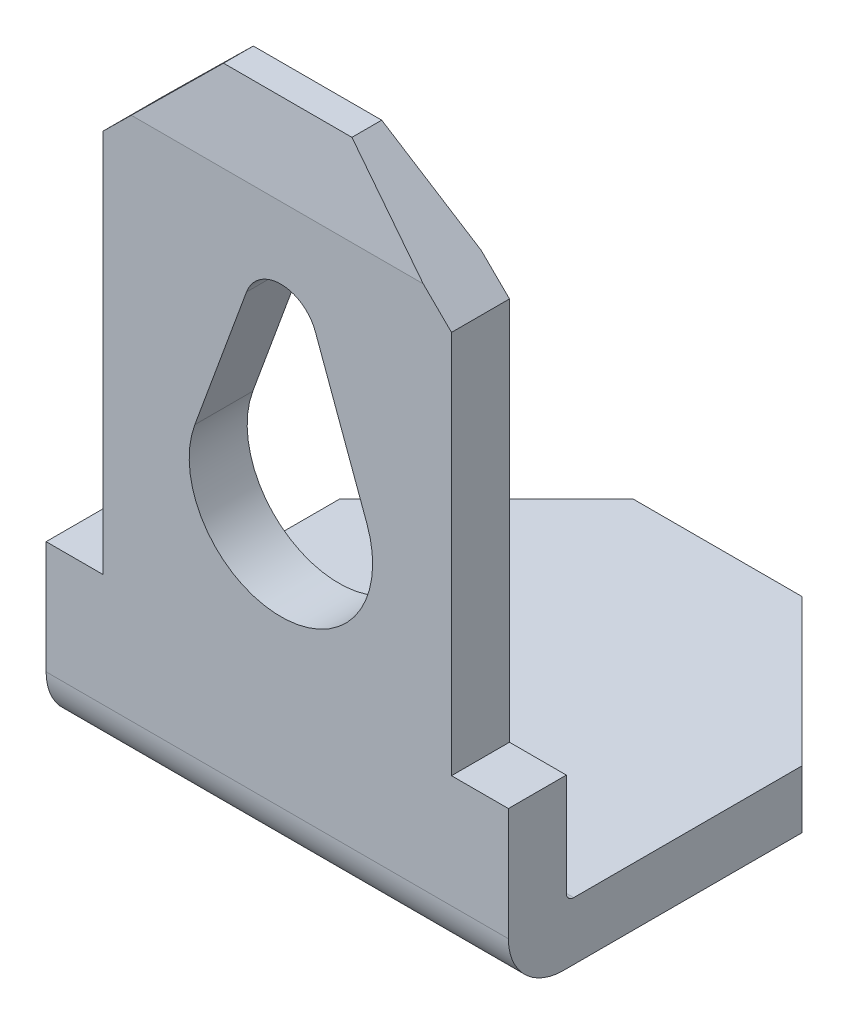
ISO-10303-21;
HEADER;
FILE_DESCRIPTION(('STEP AP214'),'2;1');
FILE_NAME('part.step','',(''),(''),'','','');
FILE_SCHEMA(('AUTOMOTIVE_DESIGN { 1 0 10303 214 1 1 1 1 }'));
ENDSEC;
DATA;
#1=APPLICATION_CONTEXT('core data for automotive mechanical design processes');
#2=APPLICATION_PROTOCOL_DEFINITION('international standard','automotive_design',2000,#1);
#3=PRODUCT_CONTEXT('',#1,'mechanical');
#4=PRODUCT('Part','Part','',(#3));
#5=PRODUCT_RELATED_PRODUCT_CATEGORY('part','',(#4));
#6=PRODUCT_DEFINITION_FORMATION('','',#4);
#7=PRODUCT_DEFINITION_CONTEXT('part definition',#1,'design');
#8=PRODUCT_DEFINITION('design','',#6,#7);
#9=PRODUCT_DEFINITION_SHAPE('','',#8);
#10=(LENGTH_UNIT() NAMED_UNIT(*) SI_UNIT(.MILLI.,.METRE.));
#11=(NAMED_UNIT(*) PLANE_ANGLE_UNIT() SI_UNIT($,.RADIAN.));
#12=(NAMED_UNIT(*) SI_UNIT($,.STERADIAN.) SOLID_ANGLE_UNIT());
#13=UNCERTAINTY_MEASURE_WITH_UNIT(LENGTH_MEASURE(1.E-05),#10,'distance_accuracy_value','');
#14=(GEOMETRIC_REPRESENTATION_CONTEXT(3) GLOBAL_UNCERTAINTY_ASSIGNED_CONTEXT((#13)) GLOBAL_UNIT_ASSIGNED_CONTEXT((#10,
#11,#12)) REPRESENTATION_CONTEXT('',''));
#15=CARTESIAN_POINT('',(0.,0.,0.));
#16=DIRECTION('',(0.,0.,1.));
#17=DIRECTION('',(1.,0.,0.));
#18=AXIS2_PLACEMENT_3D('',#15,#16,#17);
#19=CARTESIAN_POINT('',(6.3,7.11,0.));
#20=DIRECTION('',(0.,-0.214348018272917,0.976757353216485));
#21=DIRECTION('',(0.,-0.976757353216485,-0.214348018272917));
#22=AXIS2_PLACEMENT_3D('',#19,#20,#21);
#23=PLANE('',#22);
#24=DIRECTION('',(-1.,0.,0.));
#25=VECTOR('',#24,1.);
#26=CARTESIAN_POINT('',(6.3,8.21,0.24139344262295));
#27=LINE('',#26,#25);
#28=CARTESIAN_POINT('',(4.025,8.21,0.241393442622949));
#29=VERTEX_POINT('',#28);
#30=CARTESIAN_POINT('',(2.275,8.21,0.241393442622949));
#31=VERTEX_POINT('',#30);
#32=EDGE_CURVE('E206',#29,#31,#27,.T.);
#33=ORIENTED_EDGE('',*,*,#32,.F.);
#34=DIRECTION('',(0.703347952461325,-0.69432379783991,-0.152368374414198));
#35=VECTOR('',#34,1.);
#36=CARTESIAN_POINT('',(5.71349472092454,6.54316914741508,-0.124390228082159));
#37=LINE('',#36,#35);
#38=CARTESIAN_POINT('',(5.13929674470966,7.11,0.));
#39=VERTEX_POINT('',#38);
#40=EDGE_CURVE('E188',#29,#39,#37,.T.);
#41=ORIENTED_EDGE('',*,*,#40,.T.);
#42=DIRECTION('',(-1.,0.,0.));
#43=VECTOR('',#42,1.);
#44=CARTESIAN_POINT('',(6.3,7.11,0.));
#45=LINE('',#44,#43);
#46=CARTESIAN_POINT('',(1.16070325529034,7.11,0.));
#47=VERTEX_POINT('',#46);
#48=EDGE_CURVE('E246',#39,#47,#45,.T.);
#49=ORIENTED_EDGE('',*,*,#48,.T.);
#50=DIRECTION('',(0.703347952461325,0.69432379783991,0.152368374414198));
#51=VECTOR('',#50,1.);
#52=CARTESIAN_POINT('',(3.70310483513415,9.61978184321707,0.550768072151585));
#53=LINE('',#52,#51);
#54=EDGE_CURVE('E254',#47,#31,#53,.T.);
#55=ORIENTED_EDGE('',*,*,#54,.T.);
#56=EDGE_LOOP('',(#33,#41,#49,#55));
#57=FACE_BOUND('',#56,.T.);
#58=ADVANCED_FACE('F34',(#57),#23,.F.);
#59=CARTESIAN_POINT('',(6.3,8.21,0.24139344262295));
#60=DIRECTION('',(0.,-1.,0.));
#61=DIRECTION('',(0.,0.,-1.));
#62=AXIS2_PLACEMENT_3D('',#59,#60,#61);
#63=PLANE('',#62);
#64=DIRECTION('',(-1.,0.,0.));
#65=VECTOR('',#64,1.);
#66=CARTESIAN_POINT('',(6.3,8.21,0.64713114754098));
#67=LINE('',#66,#65);
#68=CARTESIAN_POINT('',(4.025,8.21,0.647131147540979));
#69=VERTEX_POINT('',#68);
#70=CARTESIAN_POINT('',(2.275,8.21,0.647131147540979));
#71=VERTEX_POINT('',#70);
#72=EDGE_CURVE('E203',#69,#71,#67,.T.);
#73=ORIENTED_EDGE('',*,*,#72,.F.);
#74=DIRECTION('',(0.,0.,1.));
#75=VECTOR('',#74,1.);
#76=CARTESIAN_POINT('',(4.025,8.21,-5.21));
#77=LINE('',#76,#75);
#78=EDGE_CURVE('E183',#29,#69,#77,.T.);
#79=ORIENTED_EDGE('',*,*,#78,.F.);
#80=ORIENTED_EDGE('',*,*,#32,.T.);
#81=DIRECTION('',(0.,0.,1.));
#82=VECTOR('',#81,1.);
#83=CARTESIAN_POINT('',(2.275,8.21,-5.21));
#84=LINE('',#83,#82);
#85=EDGE_CURVE('E198',#31,#71,#84,.T.);
#86=ORIENTED_EDGE('',*,*,#85,.T.);
#87=EDGE_LOOP('',(#73,#79,#80,#86));
#88=FACE_BOUND('',#87,.T.);
#89=ADVANCED_FACE('F415',(#88),#63,.F.);
#90=CARTESIAN_POINT('',(6.3,8.21,0.64713114754098));
#91=DIRECTION('',(0.,-0.128798962302804,-0.991670725245896));
#92=DIRECTION('',(0.,0.991670725245896,-0.128798962302804));
#93=AXIS2_PLACEMENT_3D('',#90,#91,#92);
#94=PLANE('',#93);
#95=DIRECTION('',(-1.,0.,0.));
#96=VECTOR('',#95,1.);
#97=CARTESIAN_POINT('',(6.3,7.11,0.79));
#98=LINE('',#97,#96);
#99=CARTESIAN_POINT('',(5.13929674470966,7.11,0.79));
#100=VERTEX_POINT('',#99);
#101=CARTESIAN_POINT('',(1.16070325529034,7.11,0.79));
#102=VERTEX_POINT('',#101);
#103=EDGE_CURVE('E195',#100,#102,#98,.T.);
#104=ORIENTED_EDGE('',*,*,#103,.F.);
#105=DIRECTION('',(-0.708713311399784,0.69962031769454,-0.0908672290418487));
#106=VECTOR('',#105,1.);
#107=CARTESIAN_POINT('',(5.16767461889319,7.0819862220274,0.793638451192715));
#108=LINE('',#107,#106);
#109=EDGE_CURVE('E180',#100,#69,#108,.T.);
#110=ORIENTED_EDGE('',*,*,#109,.T.);
#111=ORIENTED_EDGE('',*,*,#72,.T.);
#112=DIRECTION('',(-0.708713311399784,-0.69962031769454,0.0908672290418487));
#113=VECTOR('',#112,1.);
#114=CARTESIAN_POINT('',(4.29665509496487,10.2057166841054,0.387925918003296));
#115=LINE('',#114,#113);
#116=EDGE_CURVE('E202',#71,#102,#115,.T.);
#117=ORIENTED_EDGE('',*,*,#116,.T.);
#118=EDGE_LOOP('',(#104,#110,#111,#117));
#119=FACE_BOUND('',#118,.T.);
#120=ADVANCED_FACE('F201',(#119),#94,.F.);
#121=CARTESIAN_POINT('',(6.3,7.11,0.79));
#122=DIRECTION('',(0.,0.,-1.));
#123=DIRECTION('',(0.,1.,0.));
#124=AXIS2_PLACEMENT_3D('',#121,#122,#123);
#125=PLANE('',#124);
#126=DIRECTION('',(-0.344583937553277,-0.938755511291561,0.));
#127=VECTOR('',#126,1.);
#128=CARTESIAN_POINT('',(2.73062224435422,5.80882986931079,0.789999999999999));
#129=LINE('',#128,#127);
#130=CARTESIAN_POINT('',(2.73062224435422,5.80882986931079,0.79));
#131=VERTEX_POINT('',#130);
#132=CARTESIAN_POINT('',(2.02655561088555,3.89072992194159,0.789999999999999));
#133=VERTEX_POINT('',#132);
#134=EDGE_CURVE('E295',#131,#133,#129,.T.);
#135=ORIENTED_EDGE('',*,*,#134,.F.);
#136=CARTESIAN_POINT('',(3.2,5.63653790053415,0.789999999999999));
#137=DIRECTION('',(0.,0.,1.));
#138=DIRECTION('',(1.,0.,0.));
#139=AXIS2_PLACEMENT_3D('',#136,#137,#138);
#140=CIRCLE('',#139,0.5);
#141=CARTESIAN_POINT('',(3.66963395220552,5.8081302981974,0.789999999999999));
#142=VERTEX_POINT('',#141);
#143=EDGE_CURVE('E271',#142,#131,#140,.T.);
#144=ORIENTED_EDGE('',*,*,#143,.F.);
#145=DIRECTION('',(-0.344584192655147,0.938755417652649,0.));
#146=VECTOR('',#145,1.);
#147=CARTESIAN_POINT('',(3.66963395220552,5.8081302981974,0.789999999999999));
#148=LINE('',#147,#146);
#149=CARTESIAN_POINT('',(4.37344427206581,3.89073024081893,0.789999999999999));
#150=VERTEX_POINT('',#149);
#151=EDGE_CURVE('E301',#150,#142,#148,.T.);
#152=ORIENTED_EDGE('',*,*,#151,.F.);
#153=CARTESIAN_POINT('',(3.2,3.46,0.789999999999999));
#154=DIRECTION('',(0.,0.,1.));
#155=DIRECTION('',(1.,0.,0.));
#156=AXIS2_PLACEMENT_3D('',#153,#154,#155);
#157=CIRCLE('',#156,1.25);
#158=EDGE_CURVE('E298',#133,#150,#157,.T.);
#159=ORIENTED_EDGE('',*,*,#158,.F.);
#160=EDGE_LOOP('',(#135,#144,#152,#159));
#161=FACE_BOUND('',#160,.T.);
#162=DIRECTION('',(0.,-1.,0.));
#163=VECTOR('',#162,1.);
#164=CARTESIAN_POINT('',(5.525,1.49672365683442,0.789999999999999));
#165=LINE('',#164,#163);
#166=CARTESIAN_POINT('',(5.525,6.729245427366,0.79));
#167=VERTEX_POINT('',#166);
#168=CARTESIAN_POINT('',(5.525,1.49672365683442,0.789999999999999));
#169=VERTEX_POINT('',#168);
#170=EDGE_CURVE('E197',#167,#169,#165,.T.);
#171=ORIENTED_EDGE('',*,*,#170,.F.);
#172=DIRECTION('',(0.711657426770076,-0.702526659225822,0.));
#173=VECTOR('',#172,1.);
#174=CARTESIAN_POINT('',(5.54449556096771,6.71,0.79));
#175=LINE('',#174,#173);
#176=EDGE_CURVE('E56',#100,#167,#175,.T.);
#177=ORIENTED_EDGE('',*,*,#176,.F.);
#178=ORIENTED_EDGE('',*,*,#103,.T.);
#179=DIRECTION('',(0.711657426770076,0.702526659225822,0.));
#180=VECTOR('',#179,1.);
#181=CARTESIAN_POINT('',(0.755504439032288,6.71,0.79));
#182=LINE('',#181,#180);
#183=CARTESIAN_POINT('',(0.775,6.729245427366,0.79));
#184=VERTEX_POINT('',#183);
#185=EDGE_CURVE('E563',#184,#102,#182,.T.);
#186=ORIENTED_EDGE('',*,*,#185,.F.);
#187=DIRECTION('',(0.,1.,0.));
#188=VECTOR('',#187,1.);
#189=CARTESIAN_POINT('',(0.775,1.49672365683442,0.789999999999999));
#190=LINE('',#189,#188);
#191=CARTESIAN_POINT('',(0.775,1.49672365683442,0.789999999999999));
#192=VERTEX_POINT('',#191);
#193=EDGE_CURVE('E272',#192,#184,#190,.T.);
#194=ORIENTED_EDGE('',*,*,#193,.F.);
#195=DIRECTION('',(1.,0.,0.));
#196=VECTOR('',#195,1.);
#197=CARTESIAN_POINT('',(0.,1.49672365683442,0.789999999999999));
#198=LINE('',#197,#196);
#199=CARTESIAN_POINT('',(0.,1.49672365683442,0.789999999999999));
#200=VERTEX_POINT('',#199);
#201=EDGE_CURVE('E265',#200,#192,#198,.T.);
#202=ORIENTED_EDGE('',*,*,#201,.F.);
#203=DIRECTION('',(0.,-1.,0.));
#204=VECTOR('',#203,1.);
#205=CARTESIAN_POINT('',(0.,7.11,0.79));
#206=LINE('',#205,#204);
#207=CARTESIAN_POINT('',(0.,-0.0400000000000005,0.789999999999999));
#208=VERTEX_POINT('',#207);
#209=EDGE_CURVE('E313',#200,#208,#206,.T.);
#210=ORIENTED_EDGE('',*,*,#209,.T.);
#211=DIRECTION('',(-1.,0.,0.));
#212=VECTOR('',#211,1.);
#213=CARTESIAN_POINT('',(6.3,-0.0400000000000005,0.789999999999999));
#214=LINE('',#213,#212);
#215=CARTESIAN_POINT('',(6.3,-0.0400000000000005,0.789999999999999));
#216=VERTEX_POINT('',#215);
#217=EDGE_CURVE('E204',#216,#208,#214,.T.);
#218=ORIENTED_EDGE('',*,*,#217,.F.);
#219=DIRECTION('',(0.,-1.,0.));
#220=VECTOR('',#219,1.);
#221=CARTESIAN_POINT('',(6.3,7.11,0.79));
#222=LINE('',#221,#220);
#223=CARTESIAN_POINT('',(6.3,1.49672365683442,0.789999999999999));
#224=VERTEX_POINT('',#223);
#225=EDGE_CURVE('E314',#224,#216,#222,.T.);
#226=ORIENTED_EDGE('',*,*,#225,.F.);
#227=DIRECTION('',(1.,0.,0.));
#228=VECTOR('',#227,1.);
#229=CARTESIAN_POINT('',(6.3,1.49672365683442,0.789999999999999));
#230=LINE('',#229,#228);
#231=EDGE_CURVE('E260',#169,#224,#230,.T.);
#232=ORIENTED_EDGE('',*,*,#231,.F.);
#233=EDGE_LOOP('',(#171,#177,#178,#186,#194,#202,#210,#218,#226,#232));
#234=FACE_BOUND('',#233,.T.);
#235=ADVANCED_FACE('F193',(#161,#234),#125,.F.);
#236=CARTESIAN_POINT('',(6.3,-0.0400000000000006,0.0399999999999991));
#237=DIRECTION('',(-1.,0.,0.));
#238=DIRECTION('',(0.,0.,1.));
#239=AXIS2_PLACEMENT_3D('',#236,#237,#238);
#240=CYLINDRICAL_SURFACE('',#239,0.75);
#241=CARTESIAN_POINT('',(0.,-0.0400000000000006,0.0399999999999991));
#242=DIRECTION('',(1.,0.,0.));
#243=DIRECTION('',(0.,0.,-1.));
#244=AXIS2_PLACEMENT_3D('',#241,#242,#243);
#245=CIRCLE('',#244,0.75);
#246=CARTESIAN_POINT('',(0.,-0.790000000000001,0.0399999999999991));
#247=VERTEX_POINT('',#246);
#248=EDGE_CURVE('E330',#208,#247,#245,.T.);
#249=ORIENTED_EDGE('',*,*,#248,.T.);
#250=DIRECTION('',(-1.,0.,0.));
#251=VECTOR('',#250,1.);
#252=CARTESIAN_POINT('',(6.3,-0.790000000000001,0.0399999999999991));
#253=LINE('',#252,#251);
#254=CARTESIAN_POINT('',(6.3,-0.790000000000001,0.0399999999999991));
#255=VERTEX_POINT('',#254);
#256=EDGE_CURVE('E209',#255,#247,#253,.T.);
#257=ORIENTED_EDGE('',*,*,#256,.F.);
#258=CARTESIAN_POINT('',(6.3,-0.0400000000000006,0.0399999999999991));
#259=DIRECTION('',(1.,0.,0.));
#260=DIRECTION('',(0.,0.,-1.));
#261=AXIS2_PLACEMENT_3D('',#258,#259,#260);
#262=CIRCLE('',#261,0.75);
#263=EDGE_CURVE('E316',#216,#255,#262,.T.);
#264=ORIENTED_EDGE('',*,*,#263,.F.);
#265=ORIENTED_EDGE('',*,*,#217,.T.);
#266=EDGE_LOOP('',(#249,#257,#264,#265));
#267=FACE_BOUND('',#266,.T.);
#268=ADVANCED_FACE('F386',(#267),#240,.T.);
#269=CARTESIAN_POINT('',(6.3,-0.790000000000001,0.0399999999999991));
#270=DIRECTION('',(0.,1.,0.));
#271=DIRECTION('',(0.,0.,1.));
#272=AXIS2_PLACEMENT_3D('',#269,#270,#271);
#273=PLANE('',#272);
#274=DIRECTION('',(-1.,0.,0.));
#275=VECTOR('',#274,1.);
#276=CARTESIAN_POINT('',(6.3,-0.790000000000001,-5.21));
#277=LINE('',#276,#275);
#278=CARTESIAN_POINT('',(4.29999999999999,-0.790000000000001,-5.21));
#279=VERTEX_POINT('',#278);
#280=CARTESIAN_POINT('',(2.,-0.790000000000001,-5.21));
#281=VERTEX_POINT('',#280);
#282=EDGE_CURVE('E351',#279,#281,#277,.T.);
#283=ORIENTED_EDGE('',*,*,#282,.F.);
#284=DIRECTION('',(0.707106781186549,0.,0.707106781186546));
#285=VECTOR('',#284,1.);
#286=CARTESIAN_POINT('',(6.3,-0.790000000000001,-3.21));
#287=LINE('',#286,#285);
#288=CARTESIAN_POINT('',(6.3,-0.790000000000001,-3.21));
#289=VERTEX_POINT('',#288);
#290=EDGE_CURVE('E229',#279,#289,#287,.T.);
#291=ORIENTED_EDGE('',*,*,#290,.T.);
#292=DIRECTION('',(0.,0.,-1.));
#293=VECTOR('',#292,1.);
#294=CARTESIAN_POINT('',(6.3,-0.790000000000001,0.0399999999999991));
#295=LINE('',#294,#293);
#296=EDGE_CURVE('E319',#255,#289,#295,.T.);
#297=ORIENTED_EDGE('',*,*,#296,.F.);
#298=ORIENTED_EDGE('',*,*,#256,.T.);
#299=DIRECTION('',(0.,0.,-1.));
#300=VECTOR('',#299,1.);
#301=CARTESIAN_POINT('',(0.,-0.790000000000001,0.0399999999999991));
#302=LINE('',#301,#300);
#303=CARTESIAN_POINT('',(0.,-0.790000000000001,-3.21));
#304=VERTEX_POINT('',#303);
#305=EDGE_CURVE('E332',#247,#304,#302,.T.);
#306=ORIENTED_EDGE('',*,*,#305,.T.);
#307=DIRECTION('',(-0.707106781186546,0.,0.707106781186549));
#308=VECTOR('',#307,1.);
#309=CARTESIAN_POINT('',(2.,-0.790000000000001,-5.21));
#310=LINE('',#309,#308);
#311=EDGE_CURVE('E227',#304,#281,#310,.F.);
#312=ORIENTED_EDGE('',*,*,#311,.T.);
#313=EDGE_LOOP('',(#283,#291,#297,#298,#306,#312));
#314=FACE_BOUND('',#313,.T.);
#315=ADVANCED_FACE('F359',(#314),#273,.F.);
#316=CARTESIAN_POINT('',(6.3,-0.790000000000001,-5.21));
#317=DIRECTION('',(0.,0.,1.));
#318=DIRECTION('',(1.,0.,0.));
#319=AXIS2_PLACEMENT_3D('',#316,#317,#318);
#320=PLANE('',#319);
#321=DIRECTION('',(-1.,0.,0.));
#322=VECTOR('',#321,1.);
#323=CARTESIAN_POINT('',(6.3,0.,-5.21));
#324=LINE('',#323,#322);
#325=CARTESIAN_POINT('',(4.29999999999999,0.,-5.21));
#326=VERTEX_POINT('',#325);
#327=CARTESIAN_POINT('',(2.,0.,-5.21));
#328=VERTEX_POINT('',#327);
#329=EDGE_CURVE('E348',#326,#328,#324,.T.);
#330=ORIENTED_EDGE('',*,*,#329,.F.);
#331=DIRECTION('',(0.,-1.,0.));
#332=VECTOR('',#331,1.);
#333=CARTESIAN_POINT('',(4.29999999999999,-0.790000000000001,-5.21));
#334=LINE('',#333,#332);
#335=EDGE_CURVE('E225',#326,#279,#334,.T.);
#336=ORIENTED_EDGE('',*,*,#335,.T.);
#337=ORIENTED_EDGE('',*,*,#282,.T.);
#338=DIRECTION('',(0.,1.,0.));
#339=VECTOR('',#338,1.);
#340=CARTESIAN_POINT('',(2.,-0.790000000000001,-5.21));
#341=LINE('',#340,#339);
#342=EDGE_CURVE('E222',#281,#328,#341,.T.);
#343=ORIENTED_EDGE('',*,*,#342,.T.);
#344=EDGE_LOOP('',(#330,#336,#337,#343));
#345=FACE_BOUND('',#344,.T.);
#346=ADVANCED_FACE('F375',(#345),#320,.F.);
#347=CARTESIAN_POINT('',(6.3,0.,-5.21));
#348=DIRECTION('',(0.,-1.,0.));
#349=DIRECTION('',(0.,0.,-1.));
#350=AXIS2_PLACEMENT_3D('',#347,#348,#349);
#351=PLANE('',#350);
#352=DIRECTION('',(0.,0.,1.));
#353=VECTOR('',#352,1.);
#354=CARTESIAN_POINT('',(6.3,0.,-5.21));
#355=LINE('',#354,#353);
#356=CARTESIAN_POINT('',(6.3,0.,-3.21));
#357=VERTEX_POINT('',#356);
#358=CARTESIAN_POINT('',(6.3,0.,-0.100000000000001));
#359=VERTEX_POINT('',#358);
#360=EDGE_CURVE('E322',#357,#359,#355,.T.);
#361=ORIENTED_EDGE('',*,*,#360,.F.);
#362=DIRECTION('',(-0.707106781186549,0.,-0.707106781186546));
#363=VECTOR('',#362,1.);
#364=CARTESIAN_POINT('',(6.3,0.,-3.21));
#365=LINE('',#364,#363);
#366=EDGE_CURVE('E220',#357,#326,#365,.T.);
#367=ORIENTED_EDGE('',*,*,#366,.T.);
#368=ORIENTED_EDGE('',*,*,#329,.T.);
#369=DIRECTION('',(0.707106781186546,0.,-0.707106781186549));
#370=VECTOR('',#369,1.);
#371=CARTESIAN_POINT('',(2.,0.,-5.21));
#372=LINE('',#371,#370);
#373=CARTESIAN_POINT('',(0.,0.,-3.21));
#374=VERTEX_POINT('',#373);
#375=EDGE_CURVE('E218',#328,#374,#372,.F.);
#376=ORIENTED_EDGE('',*,*,#375,.T.);
#377=DIRECTION('',(0.,0.,1.));
#378=VECTOR('',#377,1.);
#379=CARTESIAN_POINT('',(0.,0.,-5.21));
#380=LINE('',#379,#378);
#381=CARTESIAN_POINT('',(0.,0.,-0.100000000000001));
#382=VERTEX_POINT('',#381);
#383=EDGE_CURVE('E335',#374,#382,#380,.T.);
#384=ORIENTED_EDGE('',*,*,#383,.T.);
#385=DIRECTION('',(-1.,0.,0.));
#386=VECTOR('',#385,1.);
#387=CARTESIAN_POINT('',(6.3,0.,-0.100000000000001));
#388=LINE('',#387,#386);
#389=EDGE_CURVE('E345',#359,#382,#388,.T.);
#390=ORIENTED_EDGE('',*,*,#389,.F.);
#391=EDGE_LOOP('',(#361,#367,#368,#376,#384,#390));
#392=FACE_BOUND('',#391,.T.);
#393=ADVANCED_FACE('F400',(#392),#351,.F.);
#394=CARTESIAN_POINT('',(6.3,0.1,-0.1));
#395=DIRECTION('',(-1.,0.,0.));
#396=DIRECTION('',(0.,0.,1.));
#397=AXIS2_PLACEMENT_3D('',#394,#395,#396);
#398=CYLINDRICAL_SURFACE('',#397,0.1);
#399=CARTESIAN_POINT('',(0.,0.1,-0.1));
#400=DIRECTION('',(-1.,0.,0.));
#401=DIRECTION('',(0.,0.,-1.));
#402=AXIS2_PLACEMENT_3D('',#399,#400,#401);
#403=CIRCLE('',#402,0.1);
#404=CARTESIAN_POINT('',(0.,0.100000000000001,0.));
#405=VERTEX_POINT('',#404);
#406=EDGE_CURVE('E337',#382,#405,#403,.T.);
#407=ORIENTED_EDGE('',*,*,#406,.T.);
#408=DIRECTION('',(-1.,0.,0.));
#409=VECTOR('',#408,1.);
#410=CARTESIAN_POINT('',(6.3,0.100000000000001,0.));
#411=LINE('',#410,#409);
#412=CARTESIAN_POINT('',(6.3,0.100000000000001,0.));
#413=VERTEX_POINT('',#412);
#414=EDGE_CURVE('E342',#413,#405,#411,.T.);
#415=ORIENTED_EDGE('',*,*,#414,.F.);
#416=CARTESIAN_POINT('',(6.3,0.1,-0.1));
#417=DIRECTION('',(-1.,0.,0.));
#418=DIRECTION('',(0.,0.,-1.));
#419=AXIS2_PLACEMENT_3D('',#416,#417,#418);
#420=CIRCLE('',#419,0.1);
#421=EDGE_CURVE('E324',#359,#413,#420,.T.);
#422=ORIENTED_EDGE('',*,*,#421,.F.);
#423=ORIENTED_EDGE('',*,*,#389,.T.);
#424=EDGE_LOOP('',(#407,#415,#422,#423));
#425=FACE_BOUND('',#424,.T.);
#426=ADVANCED_FACE('F397',(#425),#398,.F.);
#427=CARTESIAN_POINT('',(6.3,0.100000000000001,0.));
#428=DIRECTION('',(0.,0.,1.));
#429=DIRECTION('',(0.,-1.,0.));
#430=AXIS2_PLACEMENT_3D('',#427,#428,#429);
#431=PLANE('',#430);
#432=DIRECTION('',(0.344584192655147,-0.938755417652649,0.));
#433=VECTOR('',#432,1.);
#434=CARTESIAN_POINT('',(3.66963395220552,5.8081302981974,0.));
#435=LINE('',#434,#433);
#436=CARTESIAN_POINT('',(3.66963395220552,5.8081302981974,0.));
#437=VERTEX_POINT('',#436);
#438=CARTESIAN_POINT('',(4.37344427206581,3.89073024081893,0.));
#439=VERTEX_POINT('',#438);
#440=EDGE_CURVE('E288',#437,#439,#435,.T.);
#441=ORIENTED_EDGE('',*,*,#440,.F.);
#442=CARTESIAN_POINT('',(3.2,5.63653790053415,0.));
#443=DIRECTION('',(0.,0.,1.));
#444=DIRECTION('',(0.,-1.,0.));
#445=AXIS2_PLACEMENT_3D('',#442,#443,#444);
#446=CIRCLE('',#445,0.5);
#447=CARTESIAN_POINT('',(2.73062224435422,5.80882986931079,0.));
#448=VERTEX_POINT('',#447);
#449=EDGE_CURVE('E291',#448,#437,#446,.F.);
#450=ORIENTED_EDGE('',*,*,#449,.F.);
#451=DIRECTION('',(0.344583937553277,0.938755511291561,0.));
#452=VECTOR('',#451,1.);
#453=CARTESIAN_POINT('',(2.73062224435422,5.80882986931079,0.));
#454=LINE('',#453,#452);
#455=CARTESIAN_POINT('',(2.02655561088555,3.89072992194159,0.));
#456=VERTEX_POINT('',#455);
#457=EDGE_CURVE('E293',#456,#448,#454,.T.);
#458=ORIENTED_EDGE('',*,*,#457,.F.);
#459=CARTESIAN_POINT('',(3.2,3.46,0.));
#460=DIRECTION('',(0.,0.,1.));
#461=DIRECTION('',(0.,-1.,0.));
#462=AXIS2_PLACEMENT_3D('',#459,#460,#461);
#463=CIRCLE('',#462,1.25);
#464=EDGE_CURVE('E285',#439,#456,#463,.F.);
#465=ORIENTED_EDGE('',*,*,#464,.F.);
#466=EDGE_LOOP('',(#441,#450,#458,#465));
#467=FACE_BOUND('',#466,.T.);
#468=ORIENTED_EDGE('',*,*,#48,.F.);
#469=DIRECTION('',(0.711657426770076,-0.702526659225822,0.));
#470=VECTOR('',#469,1.);
#471=CARTESIAN_POINT('',(9.23184999768602,3.06995537127141,0.));
#472=LINE('',#471,#470);
#473=CARTESIAN_POINT('',(5.525,6.729245427366,0.));
#474=VERTEX_POINT('',#473);
#475=EDGE_CURVE('E239',#39,#474,#472,.T.);
#476=ORIENTED_EDGE('',*,*,#475,.T.);
#477=DIRECTION('',(0.,1.,0.));
#478=VECTOR('',#477,1.);
#479=CARTESIAN_POINT('',(5.525,1.49672365683442,0.));
#480=LINE('',#479,#478);
#481=CARTESIAN_POINT('',(5.525,1.49672365683442,0.));
#482=VERTEX_POINT('',#481);
#483=EDGE_CURVE('E237',#482,#474,#480,.T.);
#484=ORIENTED_EDGE('',*,*,#483,.F.);
#485=DIRECTION('',(-1.,0.,0.));
#486=VECTOR('',#485,1.);
#487=CARTESIAN_POINT('',(6.3,1.49672365683442,0.));
#488=LINE('',#487,#486);
#489=CARTESIAN_POINT('',(6.3,1.49672365683442,0.));
#490=VERTEX_POINT('',#489);
#491=EDGE_CURVE('E262',#490,#482,#488,.T.);
#492=ORIENTED_EDGE('',*,*,#491,.F.);
#493=DIRECTION('',(0.,1.,0.));
#494=VECTOR('',#493,1.);
#495=CARTESIAN_POINT('',(6.3,0.100000000000001,0.));
#496=LINE('',#495,#494);
#497=EDGE_CURVE('E326',#413,#490,#496,.T.);
#498=ORIENTED_EDGE('',*,*,#497,.F.);
#499=ORIENTED_EDGE('',*,*,#414,.T.);
#500=DIRECTION('',(0.,1.,0.));
#501=VECTOR('',#500,1.);
#502=CARTESIAN_POINT('',(0.,0.100000000000001,0.));
#503=LINE('',#502,#501);
#504=CARTESIAN_POINT('',(0.,1.49672365683442,0.));
#505=VERTEX_POINT('',#504);
#506=EDGE_CURVE('E317',#405,#505,#503,.T.);
#507=ORIENTED_EDGE('',*,*,#506,.T.);
#508=DIRECTION('',(-1.,0.,0.));
#509=VECTOR('',#508,1.);
#510=CARTESIAN_POINT('',(0.,1.49672365683442,0.));
#511=LINE('',#510,#509);
#512=CARTESIAN_POINT('',(0.775,1.49672365683442,0.));
#513=VERTEX_POINT('',#512);
#514=EDGE_CURVE('E278',#513,#505,#511,.T.);
#515=ORIENTED_EDGE('',*,*,#514,.F.);
#516=DIRECTION('',(0.,-1.,0.));
#517=VECTOR('',#516,1.);
#518=CARTESIAN_POINT('',(0.775,1.49672365683442,0.));
#519=LINE('',#518,#517);
#520=CARTESIAN_POINT('',(0.775,6.729245427366,0.));
#521=VERTEX_POINT('',#520);
#522=EDGE_CURVE('E258',#521,#513,#519,.T.);
#523=ORIENTED_EDGE('',*,*,#522,.F.);
#524=DIRECTION('',(0.711657426770076,0.702526659225822,0.));
#525=VECTOR('',#524,1.);
#526=CARTESIAN_POINT('',(0.258824648699115,6.21969275288617,0.));
#527=LINE('',#526,#525);
#528=EDGE_CURVE('E49',#521,#47,#527,.T.);
#529=ORIENTED_EDGE('',*,*,#528,.T.);
#530=EDGE_LOOP('',(#468,#476,#484,#492,#498,#499,#507,#515,#523,#529));
#531=FACE_BOUND('',#530,.T.);
#532=ADVANCED_FACE('F243',(#467,#531),#431,.F.);
#533=CARTESIAN_POINT('',(6.3,-0.0400000000000006,0.0399999999999991));
#534=DIRECTION('',(1.,0.,0.));
#535=DIRECTION('',(0.,0.,-1.));
#536=AXIS2_PLACEMENT_3D('',#533,#534,#535);
#537=PLANE('',#536);
#538=DIRECTION('',(0.,0.,-1.));
#539=VECTOR('',#538,1.);
#540=CARTESIAN_POINT('',(6.3,1.49672365683442,7.54786240313508));
#541=LINE('',#540,#539);
#542=EDGE_CURVE('E267',#224,#490,#541,.T.);
#543=ORIENTED_EDGE('',*,*,#542,.F.);
#544=ORIENTED_EDGE('',*,*,#225,.T.);
#545=ORIENTED_EDGE('',*,*,#263,.T.);
#546=ORIENTED_EDGE('',*,*,#296,.T.);
#547=DIRECTION('',(0.,1.,0.));
#548=VECTOR('',#547,1.);
#549=CARTESIAN_POINT('',(6.3,0.,-3.21));
#550=LINE('',#549,#548);
#551=EDGE_CURVE('E215',#289,#357,#550,.T.);
#552=ORIENTED_EDGE('',*,*,#551,.T.);
#553=ORIENTED_EDGE('',*,*,#360,.T.);
#554=ORIENTED_EDGE('',*,*,#421,.T.);
#555=ORIENTED_EDGE('',*,*,#497,.T.);
#556=EDGE_LOOP('',(#543,#544,#545,#546,#552,#553,#554,#555));
#557=FACE_BOUND('',#556,.T.);
#558=ADVANCED_FACE('F382',(#557),#537,.T.);
#559=CARTESIAN_POINT('',(0.,-0.0400000000000006,0.0399999999999991));
#560=DIRECTION('',(1.,0.,0.));
#561=DIRECTION('',(0.,0.,-1.));
#562=AXIS2_PLACEMENT_3D('',#559,#560,#561);
#563=PLANE('',#562);
#564=ORIENTED_EDGE('',*,*,#209,.F.);
#565=DIRECTION('',(0.,0.,-1.));
#566=VECTOR('',#565,1.);
#567=CARTESIAN_POINT('',(0.,1.49672365683442,7.54786240313508));
#568=LINE('',#567,#566);
#569=EDGE_CURVE('E275',#200,#505,#568,.T.);
#570=ORIENTED_EDGE('',*,*,#569,.T.);
#571=ORIENTED_EDGE('',*,*,#506,.F.);
#572=ORIENTED_EDGE('',*,*,#406,.F.);
#573=ORIENTED_EDGE('',*,*,#383,.F.);
#574=DIRECTION('',(0.,-1.,0.));
#575=VECTOR('',#574,1.);
#576=CARTESIAN_POINT('',(0.,-0.0400000000000006,-3.21));
#577=LINE('',#576,#575);
#578=EDGE_CURVE('E231',#374,#304,#577,.T.);
#579=ORIENTED_EDGE('',*,*,#578,.T.);
#580=ORIENTED_EDGE('',*,*,#305,.F.);
#581=ORIENTED_EDGE('',*,*,#248,.F.);
#582=EDGE_LOOP('',(#564,#570,#571,#572,#573,#579,#580,#581));
#583=FACE_BOUND('',#582,.T.);
#584=ADVANCED_FACE('F366',(#583),#563,.F.);
#585=CARTESIAN_POINT('',(6.3,-0.0400000000000006,-3.21));
#586=DIRECTION('',(0.707106781186546,0.,-0.707106781186549));
#587=DIRECTION('',(0.,-1.,0.));
#588=AXIS2_PLACEMENT_3D('',#585,#586,#587);
#589=PLANE('',#588);
#590=ORIENTED_EDGE('',*,*,#290,.F.);
#591=ORIENTED_EDGE('',*,*,#335,.F.);
#592=ORIENTED_EDGE('',*,*,#366,.F.);
#593=ORIENTED_EDGE('',*,*,#551,.F.);
#594=EDGE_LOOP('',(#590,#591,#592,#593));
#595=FACE_BOUND('',#594,.T.);
#596=ADVANCED_FACE('F378',(#595),#589,.T.);
#597=CARTESIAN_POINT('',(2.,-0.790000000000001,-5.21));
#598=DIRECTION('',(0.707106781186549,0.,0.707106781186546));
#599=DIRECTION('',(0.,1.,0.));
#600=AXIS2_PLACEMENT_3D('',#597,#598,#599);
#601=PLANE('',#600);
#602=ORIENTED_EDGE('',*,*,#311,.F.);
#603=ORIENTED_EDGE('',*,*,#578,.F.);
#604=ORIENTED_EDGE('',*,*,#375,.F.);
#605=ORIENTED_EDGE('',*,*,#342,.F.);
#606=EDGE_LOOP('',(#602,#603,#604,#605));
#607=FACE_BOUND('',#606,.T.);
#608=ADVANCED_FACE('F36',(#607),#601,.F.);
#609=CARTESIAN_POINT('',(3.2,5.63653790053415,-4.65485766531385));
#610=DIRECTION('',(0.,0.,1.));
#611=DIRECTION('',(1.,0.,0.));
#612=AXIS2_PLACEMENT_3D('',#609,#610,#611);
#613=CYLINDRICAL_SURFACE('',#612,0.5);
#614=ORIENTED_EDGE('',*,*,#449,.T.);
#615=DIRECTION('',(0.,0.,1.));
#616=VECTOR('',#615,1.);
#617=CARTESIAN_POINT('',(3.66963395220552,5.8081302981974,-4.65485766531385));
#618=LINE('',#617,#616);
#619=EDGE_CURVE('E289',#437,#142,#618,.T.);
#620=ORIENTED_EDGE('',*,*,#619,.T.);
#621=ORIENTED_EDGE('',*,*,#143,.T.);
#622=DIRECTION('',(0.,0.,1.));
#623=VECTOR('',#622,1.);
#624=CARTESIAN_POINT('',(2.73062224435422,5.80882986931079,-4.65485766531385));
#625=LINE('',#624,#623);
#626=EDGE_CURVE('E304',#448,#131,#625,.T.);
#627=ORIENTED_EDGE('',*,*,#626,.F.);
#628=EDGE_LOOP('',(#614,#620,#621,#627));
#629=FACE_BOUND('',#628,.T.);
#630=ADVANCED_FACE('F430',(#629),#613,.F.);
#631=CARTESIAN_POINT('',(3.66963395220552,5.8081302981974,-4.65485766531385));
#632=DIRECTION('',(0.93875541765265,0.344584192655147,0.));
#633=DIRECTION('',(-0.344584192655147,0.938755417652649,0.));
#634=AXIS2_PLACEMENT_3D('',#631,#632,#633);
#635=PLANE('',#634);
#636=ORIENTED_EDGE('',*,*,#440,.T.);
#637=DIRECTION('',(0.,0.,1.));
#638=VECTOR('',#637,1.);
#639=CARTESIAN_POINT('',(4.37344427206581,3.89073024081893,-4.65485766531385));
#640=LINE('',#639,#638);
#641=EDGE_CURVE('E306',#439,#150,#640,.T.);
#642=ORIENTED_EDGE('',*,*,#641,.T.);
#643=ORIENTED_EDGE('',*,*,#151,.T.);
#644=ORIENTED_EDGE('',*,*,#619,.F.);
#645=EDGE_LOOP('',(#636,#642,#643,#644));
#646=FACE_BOUND('',#645,.T.);
#647=ADVANCED_FACE('F572',(#646),#635,.F.);
#648=CARTESIAN_POINT('',(3.2,3.46,-4.65485766531385));
#649=DIRECTION('',(0.,0.,1.));
#650=DIRECTION('',(1.,0.,0.));
#651=AXIS2_PLACEMENT_3D('',#648,#649,#650);
#652=CYLINDRICAL_SURFACE('',#651,1.25);
#653=ORIENTED_EDGE('',*,*,#464,.T.);
#654=DIRECTION('',(0.,0.,1.));
#655=VECTOR('',#654,1.);
#656=CARTESIAN_POINT('',(2.02655561088555,3.89072992194159,-4.65485766531385));
#657=LINE('',#656,#655);
#658=EDGE_CURVE('E308',#456,#133,#657,.T.);
#659=ORIENTED_EDGE('',*,*,#658,.T.);
#660=ORIENTED_EDGE('',*,*,#158,.T.);
#661=ORIENTED_EDGE('',*,*,#641,.F.);
#662=EDGE_LOOP('',(#653,#659,#660,#661));
#663=FACE_BOUND('',#662,.T.);
#664=ADVANCED_FACE('F568',(#663),#652,.F.);
#665=CARTESIAN_POINT('',(2.73062224435422,5.80882986931079,-4.65485766531385));
#666=DIRECTION('',(-0.938755511291561,0.344583937553277,0.));
#667=DIRECTION('',(-0.344583937553277,-0.938755511291561,0.));
#668=AXIS2_PLACEMENT_3D('',#665,#666,#667);
#669=PLANE('',#668);
#670=ORIENTED_EDGE('',*,*,#457,.T.);
#671=ORIENTED_EDGE('',*,*,#626,.T.);
#672=ORIENTED_EDGE('',*,*,#134,.T.);
#673=ORIENTED_EDGE('',*,*,#658,.F.);
#674=EDGE_LOOP('',(#670,#671,#672,#673));
#675=FACE_BOUND('',#674,.T.);
#676=ADVANCED_FACE('F497',(#675),#669,.F.);
#677=CARTESIAN_POINT('',(0.775,1.49672365683442,7.54786240313508));
#678=DIRECTION('',(1.,0.,0.));
#679=DIRECTION('',(0.,0.,-1.));
#680=AXIS2_PLACEMENT_3D('',#677,#678,#679);
#681=PLANE('',#680);
#682=ORIENTED_EDGE('',*,*,#193,.T.);
#683=DIRECTION('',(0.,0.,-1.));
#684=VECTOR('',#683,1.);
#685=CARTESIAN_POINT('',(0.775,6.729245427366,7.54786240313508));
#686=LINE('',#685,#684);
#687=EDGE_CURVE('E11',#184,#521,#686,.T.);
#688=ORIENTED_EDGE('',*,*,#687,.T.);
#689=ORIENTED_EDGE('',*,*,#522,.T.);
#690=DIRECTION('',(0.,0.,-1.));
#691=VECTOR('',#690,1.);
#692=CARTESIAN_POINT('',(0.775,1.49672365683442,7.54786240313508));
#693=LINE('',#692,#691);
#694=EDGE_CURVE('E280',#192,#513,#693,.T.);
#695=ORIENTED_EDGE('',*,*,#694,.F.);
#696=EDGE_LOOP('',(#682,#688,#689,#695));
#697=FACE_BOUND('',#696,.T.);
#698=ADVANCED_FACE('F510',(#697),#681,.F.);
#699=CARTESIAN_POINT('',(0.,1.49672365683442,7.54786240313508));
#700=DIRECTION('',(0.,-1.,0.));
#701=DIRECTION('',(0.,0.,-1.));
#702=AXIS2_PLACEMENT_3D('',#699,#700,#701);
#703=PLANE('',#702);
#704=ORIENTED_EDGE('',*,*,#201,.T.);
#705=ORIENTED_EDGE('',*,*,#694,.T.);
#706=ORIENTED_EDGE('',*,*,#514,.T.);
#707=ORIENTED_EDGE('',*,*,#569,.F.);
#708=EDGE_LOOP('',(#704,#705,#706,#707));
#709=FACE_BOUND('',#708,.T.);
#710=ADVANCED_FACE('F411',(#709),#703,.F.);
#711=CARTESIAN_POINT('',(5.525,1.49672365683442,7.54786240313508));
#712=DIRECTION('',(-1.,0.,0.));
#713=DIRECTION('',(0.,0.,1.));
#714=AXIS2_PLACEMENT_3D('',#711,#712,#713);
#715=PLANE('',#714);
#716=ORIENTED_EDGE('',*,*,#483,.T.);
#717=DIRECTION('',(0.,0.,1.));
#718=VECTOR('',#717,1.);
#719=CARTESIAN_POINT('',(5.525,6.729245427366,7.54786240313508));
#720=LINE('',#719,#718);
#721=EDGE_CURVE('E42',#474,#167,#720,.T.);
#722=ORIENTED_EDGE('',*,*,#721,.T.);
#723=ORIENTED_EDGE('',*,*,#170,.T.);
#724=DIRECTION('',(0.,0.,-1.));
#725=VECTOR('',#724,1.);
#726=CARTESIAN_POINT('',(5.525,1.49672365683442,7.54786240313508));
#727=LINE('',#726,#725);
#728=EDGE_CURVE('E261',#169,#482,#727,.T.);
#729=ORIENTED_EDGE('',*,*,#728,.T.);
#730=EDGE_LOOP('',(#716,#722,#723,#729));
#731=FACE_BOUND('',#730,.T.);
#732=ADVANCED_FACE('F234',(#731),#715,.F.);
#733=CARTESIAN_POINT('',(6.3,1.49672365683442,7.54786240313508));
#734=DIRECTION('',(0.,-1.,0.));
#735=DIRECTION('',(0.,0.,-1.));
#736=AXIS2_PLACEMENT_3D('',#733,#734,#735);
#737=PLANE('',#736);
#738=ORIENTED_EDGE('',*,*,#231,.T.);
#739=ORIENTED_EDGE('',*,*,#542,.T.);
#740=ORIENTED_EDGE('',*,*,#491,.T.);
#741=ORIENTED_EDGE('',*,*,#728,.F.);
#742=EDGE_LOOP('',(#738,#739,#740,#741));
#743=FACE_BOUND('',#742,.T.);
#744=ADVANCED_FACE('F402',(#743),#737,.F.);
#745=CARTESIAN_POINT('',(5.54449556096771,6.71,-5.21));
#746=DIRECTION('',(-0.702526659225822,-0.711657426770076,0.));
#747=DIRECTION('',(0.711657426770076,-0.702526659225822,0.));
#748=AXIS2_PLACEMENT_3D('',#745,#746,#747);
#749=PLANE('',#748);
#750=ORIENTED_EDGE('',*,*,#176,.T.);
#751=ORIENTED_EDGE('',*,*,#721,.F.);
#752=ORIENTED_EDGE('',*,*,#475,.F.);
#753=ORIENTED_EDGE('',*,*,#40,.F.);
#754=ORIENTED_EDGE('',*,*,#78,.T.);
#755=ORIENTED_EDGE('',*,*,#109,.F.);
#756=EDGE_LOOP('',(#750,#751,#752,#753,#754,#755));
#757=FACE_BOUND('',#756,.T.);
#758=ADVANCED_FACE('F181',(#757),#749,.F.);
#759=CARTESIAN_POINT('',(0.755504439032288,6.71,-5.21));
#760=DIRECTION('',(0.702526659225822,-0.711657426770076,0.));
#761=DIRECTION('',(0.711657426770076,0.702526659225822,0.));
#762=AXIS2_PLACEMENT_3D('',#759,#760,#761);
#763=PLANE('',#762);
#764=ORIENTED_EDGE('',*,*,#85,.F.);
#765=ORIENTED_EDGE('',*,*,#54,.F.);
#766=ORIENTED_EDGE('',*,*,#528,.F.);
#767=ORIENTED_EDGE('',*,*,#687,.F.);
#768=ORIENTED_EDGE('',*,*,#185,.T.);
#769=ORIENTED_EDGE('',*,*,#116,.F.);
#770=EDGE_LOOP('',(#764,#765,#766,#767,#768,#769));
#771=FACE_BOUND('',#770,.T.);
#772=ADVANCED_FACE('F409',(#771),#763,.F.);
#773=CLOSED_SHELL('',(#58,#89,#120,#235,#268,#315,#346,#393,#426,#532,#558,#584,#596,#608,#630,
#647,#664,#676,#698,#710,#732,#744,#758,#772));
#774=MANIFOLD_SOLID_BREP('B2',#773);
#775=ADVANCED_BREP_SHAPE_REPRESENTATION('',(#18,#774),#14);
#776=SHAPE_DEFINITION_REPRESENTATION(#9,#775);
ENDSEC;
END-ISO-10303-21;
